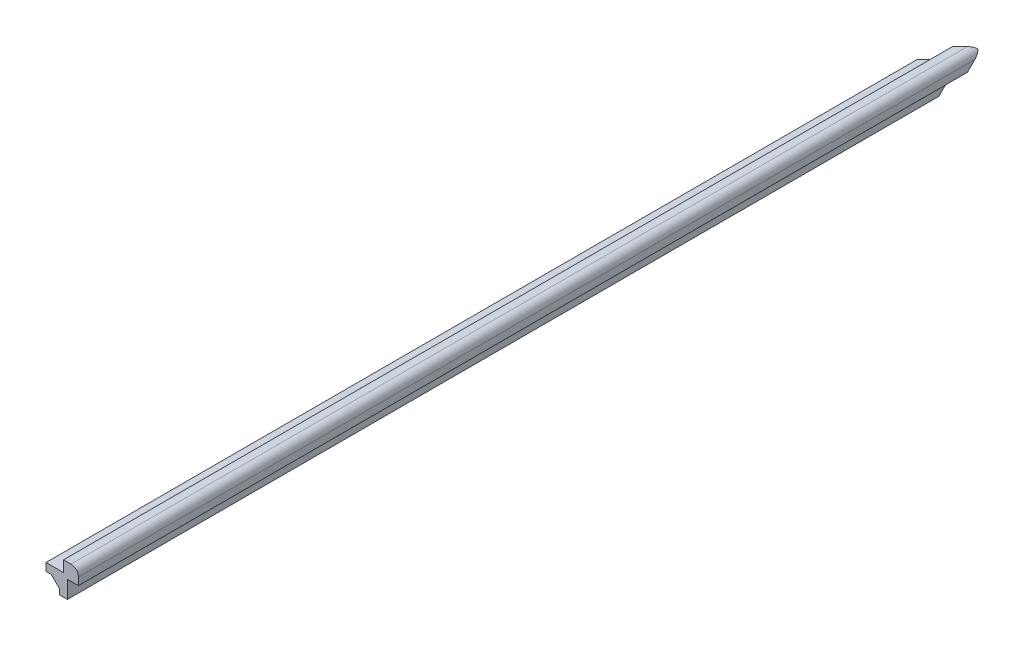
ISO-10303-21;
HEADER;
FILE_DESCRIPTION(('STEP AP214'),'2;1');
FILE_NAME('part.step','',(''),(''),'','','');
FILE_SCHEMA(('AUTOMOTIVE_DESIGN { 1 0 10303 214 1 1 1 1 }'));
ENDSEC;
DATA;
#1=APPLICATION_CONTEXT('core data for automotive mechanical design processes');
#2=APPLICATION_PROTOCOL_DEFINITION('international standard','automotive_design',2000,#1);
#3=PRODUCT_CONTEXT('',#1,'mechanical');
#4=PRODUCT('Part','Part','',(#3));
#5=PRODUCT_RELATED_PRODUCT_CATEGORY('part','',(#4));
#6=PRODUCT_DEFINITION_FORMATION('','',#4);
#7=PRODUCT_DEFINITION_CONTEXT('part definition',#1,'design');
#8=PRODUCT_DEFINITION('design','',#6,#7);
#9=PRODUCT_DEFINITION_SHAPE('','',#8);
#10=(LENGTH_UNIT() NAMED_UNIT(*) SI_UNIT(.MILLI.,.METRE.));
#11=(NAMED_UNIT(*) PLANE_ANGLE_UNIT() SI_UNIT($,.RADIAN.));
#12=(NAMED_UNIT(*) SI_UNIT($,.STERADIAN.) SOLID_ANGLE_UNIT());
#13=UNCERTAINTY_MEASURE_WITH_UNIT(LENGTH_MEASURE(1.E-05),#10,'distance_accuracy_value','');
#14=(GEOMETRIC_REPRESENTATION_CONTEXT(3) GLOBAL_UNCERTAINTY_ASSIGNED_CONTEXT((#13)) GLOBAL_UNIT_ASSIGNED_CONTEXT((#10,
#11,#12)) REPRESENTATION_CONTEXT('',''));
#15=CARTESIAN_POINT('',(0.,0.,0.));
#16=DIRECTION('',(0.,0.,1.));
#17=DIRECTION('',(1.,0.,0.));
#18=AXIS2_PLACEMENT_3D('',#15,#16,#17);
#19=CARTESIAN_POINT('',(-7.3025,-3.621225168,130.175));
#20=DIRECTION('',(0.,1.,0.));
#21=DIRECTION('',(0.,0.,1.));
#22=AXIS2_PLACEMENT_3D('',#19,#20,#21);
#23=PLANE('',#22);
#24=DIRECTION('',(0.,0.,-1.));
#25=VECTOR('',#24,1.);
#26=CARTESIAN_POINT('',(-7.3025,-3.621225168,130.175));
#27=LINE('',#26,#25);
#28=CARTESIAN_POINT('',(-7.3025,-3.621225168,130.175));
#29=VERTEX_POINT('',#28);
#30=CARTESIAN_POINT('',(-7.30249999999999,-3.621225168,-106.402378));
#31=VERTEX_POINT('',#30);
#32=EDGE_CURVE('E245',#29,#31,#27,.T.);
#33=ORIENTED_EDGE('',*,*,#32,.T.);
#34=DIRECTION('',(0.707106781186549,0.,-0.707106781186546));
#35=VECTOR('',#34,1.);
#36=CARTESIAN_POINT('',(-125.591189,-3.621225168,11.8863109999993));
#37=LINE('',#36,#35);
#38=CARTESIAN_POINT('',(-5.8662891982673,-3.62122516800001,-107.838588801733));
#39=VERTEX_POINT('',#38);
#40=EDGE_CURVE('E151',#31,#39,#37,.T.);
#41=ORIENTED_EDGE('',*,*,#40,.T.);
#42=DIRECTION('',(0.,0.,-1.));
#43=VECTOR('',#42,1.);
#44=CARTESIAN_POINT('',(-5.8662891982673,-3.621225168,130.175));
#45=LINE('',#44,#43);
#46=CARTESIAN_POINT('',(-5.8662891982673,-3.621225168,130.175));
#47=VERTEX_POINT('',#46);
#48=EDGE_CURVE('E63',#47,#39,#45,.T.);
#49=ORIENTED_EDGE('',*,*,#48,.F.);
#50=DIRECTION('',(1.,0.,0.));
#51=VECTOR('',#50,1.);
#52=CARTESIAN_POINT('',(-7.3025,-3.621225168,130.175));
#53=LINE('',#52,#51);
#54=EDGE_CURVE('E231',#29,#47,#53,.T.);
#55=ORIENTED_EDGE('',*,*,#54,.F.);
#56=EDGE_LOOP('',(#33,#41,#49,#55));
#57=FACE_BOUND('',#56,.T.);
#58=ADVANCED_FACE('F39',(#57),#23,.F.);
#59=CARTESIAN_POINT('',(-3.62122516800001,-2.53999999999999,130.175));
#60=DIRECTION('',(1.,0.,0.));
#61=DIRECTION('',(0.,1.,0.));
#62=AXIS2_PLACEMENT_3D('',#59,#60,#61);
#63=PLANE('',#62);
#64=DIRECTION('',(0.,0.,-1.));
#65=VECTOR('',#64,1.);
#66=CARTESIAN_POINT('',(-3.62122516800001,-5.86628919826729,130.175));
#67=LINE('',#66,#65);
#68=CARTESIAN_POINT('',(-3.62122516800002,-5.86628919826728,130.175));
#69=VERTEX_POINT('',#68);
#70=CARTESIAN_POINT('',(-3.62122516800004,-5.86628919826727,-107.838588801733));
#71=VERTEX_POINT('',#70);
#72=EDGE_CURVE('E196',#69,#71,#67,.T.);
#73=ORIENTED_EDGE('',*,*,#72,.T.);
#74=DIRECTION('',(0.,-0.707106781186547,0.707106781186548));
#75=VECTOR('',#74,1.);
#76=CARTESIAN_POINT('',(-3.62122516800041,-123.209939,9.50506100000018));
#77=LINE('',#76,#75);
#78=CARTESIAN_POINT('',(-3.62122516800002,-7.3025,-106.402378));
#79=VERTEX_POINT('',#78);
#80=EDGE_CURVE('E143',#71,#79,#77,.T.);
#81=ORIENTED_EDGE('',*,*,#80,.T.);
#82=DIRECTION('',(0.,0.,-1.));
#83=VECTOR('',#82,1.);
#84=CARTESIAN_POINT('',(-3.62122516800002,-7.30249999999999,130.175));
#85=LINE('',#84,#83);
#86=CARTESIAN_POINT('',(-3.62122516800002,-7.30249999999999,130.175));
#87=VERTEX_POINT('',#86);
#88=EDGE_CURVE('E223',#87,#79,#85,.T.);
#89=ORIENTED_EDGE('',*,*,#88,.F.);
#90=DIRECTION('',(0.,-1.,0.));
#91=VECTOR('',#90,1.);
#92=CARTESIAN_POINT('',(-3.62122516800001,-2.53999999999999,130.175));
#93=LINE('',#92,#91);
#94=EDGE_CURVE('E206',#69,#87,#93,.T.);
#95=ORIENTED_EDGE('',*,*,#94,.F.);
#96=EDGE_LOOP('',(#73,#81,#89,#95));
#97=FACE_BOUND('',#96,.T.);
#98=ADVANCED_FACE('F302',(#97),#63,.F.);
#99=CARTESIAN_POINT('',(-7.3025,-1.500000048,130.175));
#100=DIRECTION('',(1.,0.,0.));
#101=DIRECTION('',(0.,0.,-1.));
#102=AXIS2_PLACEMENT_3D('',#99,#100,#101);
#103=PLANE('',#102);
#104=DIRECTION('',(0.,0.,-1.));
#105=VECTOR('',#104,1.);
#106=CARTESIAN_POINT('',(-7.3025,-1.500000048,130.175));
#107=LINE('',#106,#105);
#108=CARTESIAN_POINT('',(-7.3025,-1.500000048,130.175));
#109=VERTEX_POINT('',#108);
#110=CARTESIAN_POINT('',(-7.3025,-1.500000048,-106.402378));
#111=VERTEX_POINT('',#110);
#112=EDGE_CURVE('E237',#109,#111,#107,.T.);
#113=ORIENTED_EDGE('',*,*,#112,.T.);
#114=DIRECTION('',(0.,-1.,0.));
#115=VECTOR('',#114,1.);
#116=CARTESIAN_POINT('',(-7.3025,-1.50000004800027,-106.402378));
#117=LINE('',#116,#115);
#118=EDGE_CURVE('E256',#111,#31,#117,.T.);
#119=ORIENTED_EDGE('',*,*,#118,.T.);
#120=ORIENTED_EDGE('',*,*,#32,.F.);
#121=DIRECTION('',(0.,-1.,0.));
#122=VECTOR('',#121,1.);
#123=CARTESIAN_POINT('',(-7.3025,-1.500000048,130.175));
#124=LINE('',#123,#122);
#125=EDGE_CURVE('E227',#109,#29,#124,.T.);
#126=ORIENTED_EDGE('',*,*,#125,.F.);
#127=EDGE_LOOP('',(#113,#119,#120,#126));
#128=FACE_BOUND('',#127,.T.);
#129=ADVANCED_FACE('F41',(#128),#103,.F.);
#130=CARTESIAN_POINT('',(-7.3025,-1.500000048,130.175));
#131=DIRECTION('',(0.,-1.,0.));
#132=DIRECTION('',(1.,0.,0.));
#133=AXIS2_PLACEMENT_3D('',#130,#131,#132);
#134=PLANE('',#133);
#135=DIRECTION('',(0.,0.,-1.));
#136=VECTOR('',#135,1.);
#137=CARTESIAN_POINT('',(-2.54,-1.500000048,130.175));
#138=LINE('',#137,#136);
#139=CARTESIAN_POINT('',(-2.54,-1.500000048,130.175));
#140=VERTEX_POINT('',#139);
#141=CARTESIAN_POINT('',(-2.54,-1.500000048,-111.164878));
#142=VERTEX_POINT('',#141);
#143=EDGE_CURVE('E241',#140,#142,#138,.T.);
#144=ORIENTED_EDGE('',*,*,#143,.T.);
#145=DIRECTION('',(-0.707106781186549,0.,0.707106781186546));
#146=VECTOR('',#145,1.);
#147=CARTESIAN_POINT('',(-125.591189,-1.50000004799996,11.8863109999993));
#148=LINE('',#147,#146);
#149=EDGE_CURVE('E259',#142,#111,#148,.T.);
#150=ORIENTED_EDGE('',*,*,#149,.T.);
#151=ORIENTED_EDGE('',*,*,#112,.F.);
#152=DIRECTION('',(-1.,0.,0.));
#153=VECTOR('',#152,1.);
#154=CARTESIAN_POINT('',(-7.3025,-1.500000048,130.175));
#155=LINE('',#154,#153);
#156=EDGE_CURVE('E234',#140,#109,#155,.T.);
#157=ORIENTED_EDGE('',*,*,#156,.F.);
#158=EDGE_LOOP('',(#144,#150,#151,#157));
#159=FACE_BOUND('',#158,.T.);
#160=ADVANCED_FACE('F307',(#159),#134,.F.);
#161=CARTESIAN_POINT('',(0.,0.,130.175));
#162=DIRECTION('',(0.,0.,1.));
#163=DIRECTION('',(1.,0.,0.));
#164=AXIS2_PLACEMENT_3D('',#161,#162,#163);
#165=PLANE('',#164);
#166=ORIENTED_EDGE('',*,*,#54,.T.);
#167=DIRECTION('',(0.707106781186547,-0.707106781186548,0.));
#168=VECTOR('',#167,1.);
#169=CARTESIAN_POINT('',(-5.8662891982673,-3.621225168,130.175));
#170=LINE('',#169,#168);
#171=EDGE_CURVE('E174',#47,#69,#170,.T.);
#172=ORIENTED_EDGE('',*,*,#171,.T.);
#173=ORIENTED_EDGE('',*,*,#94,.T.);
#174=DIRECTION('',(1.,0.,0.));
#175=VECTOR('',#174,1.);
#176=CARTESIAN_POINT('',(-1.50000004800003,-7.30249999999999,130.175));
#177=LINE('',#176,#175);
#178=CARTESIAN_POINT('',(-1.50000004800003,-7.30249999999999,130.175));
#179=VERTEX_POINT('',#178);
#180=EDGE_CURVE('E209',#87,#179,#177,.T.);
#181=ORIENTED_EDGE('',*,*,#180,.T.);
#182=DIRECTION('',(0.,1.,0.));
#183=VECTOR('',#182,1.);
#184=CARTESIAN_POINT('',(-1.50000004800001,-2.53999999999999,130.175));
#185=LINE('',#184,#183);
#186=CARTESIAN_POINT('',(-1.50000004800001,-2.53999999999999,130.175));
#187=VERTEX_POINT('',#186);
#188=EDGE_CURVE('E212',#179,#187,#185,.T.);
#189=ORIENTED_EDGE('',*,*,#188,.T.);
#190=DIRECTION('',(1.,0.,0.));
#191=VECTOR('',#190,1.);
#192=CARTESIAN_POINT('',(-1.50000004800001,-2.53999999999999,130.175));
#193=LINE('',#192,#191);
#194=CARTESIAN_POINT('',(1.50000004799999,-2.54,130.175));
#195=VERTEX_POINT('',#194);
#196=EDGE_CURVE('E178',#187,#195,#193,.T.);
#197=ORIENTED_EDGE('',*,*,#196,.T.);
#198=DIRECTION('',(0.,1.,0.));
#199=VECTOR('',#198,1.);
#200=CARTESIAN_POINT('',(1.50000004799999,-0.519999976000008,130.175));
#201=LINE('',#200,#199);
#202=CARTESIAN_POINT('',(1.50000004799999,-0.519999976000008,130.175));
#203=VERTEX_POINT('',#202);
#204=EDGE_CURVE('E181',#195,#203,#201,.T.);
#205=ORIENTED_EDGE('',*,*,#204,.T.);
#206=CARTESIAN_POINT('',(-0.519999976000015,-0.519999976000021,130.175));
#207=DIRECTION('',(0.,0.,1.));
#208=DIRECTION('',(-1.,0.,0.));
#209=AXIS2_PLACEMENT_3D('',#206,#207,#208);
#210=CIRCLE('',#209,2.02000002400001);
#211=CARTESIAN_POINT('',(-0.519999976000003,1.50000004799999,130.175));
#212=VERTEX_POINT('',#211);
#213=EDGE_CURVE('E184',#203,#212,#210,.T.);
#214=ORIENTED_EDGE('',*,*,#213,.T.);
#215=DIRECTION('',(-1.,0.,0.));
#216=VECTOR('',#215,1.);
#217=CARTESIAN_POINT('',(-2.54,1.500000048,130.175));
#218=LINE('',#217,#216);
#219=CARTESIAN_POINT('',(-2.54,1.500000048,130.175));
#220=VERTEX_POINT('',#219);
#221=EDGE_CURVE('E159',#212,#220,#218,.T.);
#222=ORIENTED_EDGE('',*,*,#221,.T.);
#223=DIRECTION('',(0.,-1.,0.));
#224=VECTOR('',#223,1.);
#225=CARTESIAN_POINT('',(-2.54,1.500000048,130.175));
#226=LINE('',#225,#224);
#227=EDGE_CURVE('E165',#220,#140,#226,.T.);
#228=ORIENTED_EDGE('',*,*,#227,.T.);
#229=ORIENTED_EDGE('',*,*,#156,.T.);
#230=ORIENTED_EDGE('',*,*,#125,.T.);
#231=EDGE_LOOP('',(#166,#172,#173,#181,#189,#197,#205,#214,#222,#228,#229,#230));
#232=FACE_BOUND('',#231,.T.);
#233=ADVANCED_FACE('F292',(#232),#165,.T.);
#234=CARTESIAN_POINT('',(-1.50000004800003,-7.30249999999999,130.175));
#235=DIRECTION('',(0.,1.,0.));
#236=DIRECTION('',(-1.,0.,0.));
#237=AXIS2_PLACEMENT_3D('',#234,#235,#236);
#238=PLANE('',#237);
#239=ORIENTED_EDGE('',*,*,#88,.T.);
#240=DIRECTION('',(1.,0.,0.));
#241=VECTOR('',#240,1.);
#242=CARTESIAN_POINT('',(-1.5000000479984,-7.30249999999999,-106.402378));
#243=LINE('',#242,#241);
#244=CARTESIAN_POINT('',(-1.50000004800003,-7.30249999999999,-106.402378));
#245=VERTEX_POINT('',#244);
#246=EDGE_CURVE('E274',#79,#245,#243,.T.);
#247=ORIENTED_EDGE('',*,*,#246,.T.);
#248=DIRECTION('',(0.,0.,-1.));
#249=VECTOR('',#248,1.);
#250=CARTESIAN_POINT('',(-1.50000004800003,-7.30249999999999,130.175));
#251=LINE('',#250,#249);
#252=EDGE_CURVE('E219',#179,#245,#251,.T.);
#253=ORIENTED_EDGE('',*,*,#252,.F.);
#254=ORIENTED_EDGE('',*,*,#180,.F.);
#255=EDGE_LOOP('',(#239,#247,#253,#254));
#256=FACE_BOUND('',#255,.T.);
#257=ADVANCED_FACE('F299',(#256),#238,.F.);
#258=CARTESIAN_POINT('',(-1.50000004800001,-2.53999999999999,130.175));
#259=DIRECTION('',(-1.,0.,0.));
#260=DIRECTION('',(0.,-1.,0.));
#261=AXIS2_PLACEMENT_3D('',#258,#259,#260);
#262=PLANE('',#261);
#263=ORIENTED_EDGE('',*,*,#252,.T.);
#264=DIRECTION('',(0.,0.707106781186547,-0.707106781186548));
#265=VECTOR('',#264,1.);
#266=CARTESIAN_POINT('',(-1.50000004800042,-123.209939,9.5050610000002));
#267=LINE('',#266,#265);
#268=CARTESIAN_POINT('',(-1.50000004800001,-2.54,-111.164878));
#269=VERTEX_POINT('',#268);
#270=EDGE_CURVE('E278',#245,#269,#267,.T.);
#271=ORIENTED_EDGE('',*,*,#270,.T.);
#272=DIRECTION('',(0.,0.,-1.));
#273=VECTOR('',#272,1.);
#274=CARTESIAN_POINT('',(-1.50000004800001,-2.53999999999999,130.175));
#275=LINE('',#274,#273);
#276=EDGE_CURVE('E215',#187,#269,#275,.T.);
#277=ORIENTED_EDGE('',*,*,#276,.F.);
#278=ORIENTED_EDGE('',*,*,#188,.F.);
#279=EDGE_LOOP('',(#263,#271,#277,#278));
#280=FACE_BOUND('',#279,.T.);
#281=ADVANCED_FACE('F297',(#280),#262,.F.);
#282=CARTESIAN_POINT('',(-0.519999976000015,-0.519999976000021,130.175));
#283=DIRECTION('',(0.,0.,-1.));
#284=DIRECTION('',(-1.,0.,0.));
#285=AXIS2_PLACEMENT_3D('',#282,#283,#284);
#286=CYLINDRICAL_SURFACE('',#285,2.02000002400001);
#287=DIRECTION('',(0.,0.,-1.));
#288=VECTOR('',#287,1.);
#289=CARTESIAN_POINT('',(1.50000004799999,-0.519999976000008,130.175));
#290=LINE('',#289,#288);
#291=CARTESIAN_POINT('',(1.50000004799999,-0.51999997600001,-113.184878024));
#292=VERTEX_POINT('',#291);
#293=EDGE_CURVE('E157',#203,#292,#290,.T.);
#294=ORIENTED_EDGE('',*,*,#293,.T.);
#295=CARTESIAN_POINT('',(-0.519999976000015,-0.519999976000021,-113.184878024));
#296=DIRECTION('',(0.,0.707106781186548,0.707106781186547));
#297=DIRECTION('',(0.,0.707106781186547,-0.707106781186548));
#298=AXIS2_PLACEMENT_3D('',#295,#296,#297);
#299=ELLIPSE('',#298,2.85671142993479,2.02000002400001);
#300=CARTESIAN_POINT('',(0.908355738967159,0.90835573896759,-114.613233738967));
#301=VERTEX_POINT('',#300);
#302=EDGE_CURVE('E147',#292,#301,#299,.T.);
#303=ORIENTED_EDGE('',*,*,#302,.T.);
#304=CARTESIAN_POINT('',(-0.519999976000015,-0.519999976000021,-113.184878024));
#305=DIRECTION('',(0.707106781186546,0.,0.707106781186549));
#306=DIRECTION('',(0.707106781186549,0.,-0.707106781186546));
#307=AXIS2_PLACEMENT_3D('',#304,#305,#306);
#308=ELLIPSE('',#307,2.85671142993478,2.02000002400001);
#309=CARTESIAN_POINT('',(-0.519999975999996,1.50000004799999,-113.184878024));
#310=VERTEX_POINT('',#309);
#311=EDGE_CURVE('E134',#301,#310,#308,.T.);
#312=ORIENTED_EDGE('',*,*,#311,.T.);
#313=DIRECTION('',(0.,0.,-1.));
#314=VECTOR('',#313,1.);
#315=CARTESIAN_POINT('',(-0.519999976000003,1.50000004799999,130.175));
#316=LINE('',#315,#314);
#317=EDGE_CURVE('E187',#212,#310,#316,.T.);
#318=ORIENTED_EDGE('',*,*,#317,.F.);
#319=ORIENTED_EDGE('',*,*,#213,.F.);
#320=EDGE_LOOP('',(#294,#303,#312,#318,#319));
#321=FACE_BOUND('',#320,.T.);
#322=ADVANCED_FACE('F154',(#321),#286,.T.);
#323=CARTESIAN_POINT('',(1.50000004799999,-0.519999976000008,130.175));
#324=DIRECTION('',(-1.,0.,0.));
#325=DIRECTION('',(0.,-1.,0.));
#326=AXIS2_PLACEMENT_3D('',#323,#324,#325);
#327=PLANE('',#326);
#328=DIRECTION('',(0.,0.,-1.));
#329=VECTOR('',#328,1.);
#330=CARTESIAN_POINT('',(1.50000004799999,-2.54,130.175));
#331=LINE('',#330,#329);
#332=CARTESIAN_POINT('',(1.50000004799999,-2.54,-111.164878));
#333=VERTEX_POINT('',#332);
#334=EDGE_CURVE('E192',#195,#333,#331,.T.);
#335=ORIENTED_EDGE('',*,*,#334,.T.);
#336=DIRECTION('',(0.,0.707106781186547,-0.707106781186548));
#337=VECTOR('',#336,1.);
#338=CARTESIAN_POINT('',(1.50000004799997,-122.199938988,8.49506098800021));
#339=LINE('',#338,#337);
#340=EDGE_CURVE('E160',#333,#292,#339,.T.);
#341=ORIENTED_EDGE('',*,*,#340,.T.);
#342=ORIENTED_EDGE('',*,*,#293,.F.);
#343=ORIENTED_EDGE('',*,*,#204,.F.);
#344=EDGE_LOOP('',(#335,#341,#342,#343));
#345=FACE_BOUND('',#344,.T.);
#346=ADVANCED_FACE('F290',(#345),#327,.F.);
#347=CARTESIAN_POINT('',(-1.50000004800001,-2.53999999999999,130.175));
#348=DIRECTION('',(0.,1.,0.));
#349=DIRECTION('',(-1.,0.,0.));
#350=AXIS2_PLACEMENT_3D('',#347,#348,#349);
#351=PLANE('',#350);
#352=ORIENTED_EDGE('',*,*,#276,.T.);
#353=DIRECTION('',(1.,0.,0.));
#354=VECTOR('',#353,1.);
#355=CARTESIAN_POINT('',(-1.50000004799837,-2.53999999999999,-111.164878));
#356=LINE('',#355,#354);
#357=EDGE_CURVE('E167',#269,#333,#356,.T.);
#358=ORIENTED_EDGE('',*,*,#357,.T.);
#359=ORIENTED_EDGE('',*,*,#334,.F.);
#360=ORIENTED_EDGE('',*,*,#196,.F.);
#361=EDGE_LOOP('',(#352,#358,#359,#360));
#362=FACE_BOUND('',#361,.T.);
#363=ADVANCED_FACE('F285',(#362),#351,.F.);
#364=CARTESIAN_POINT('',(-2.54,1.500000048,130.175));
#365=DIRECTION('',(1.,0.,0.));
#366=DIRECTION('',(0.,0.,-1.));
#367=AXIS2_PLACEMENT_3D('',#364,#365,#366);
#368=PLANE('',#367);
#369=DIRECTION('',(0.,0.,-1.));
#370=VECTOR('',#369,1.);
#371=CARTESIAN_POINT('',(-2.54,1.500000048,130.175));
#372=LINE('',#371,#370);
#373=CARTESIAN_POINT('',(-2.54,1.500000048,-111.164878));
#374=VERTEX_POINT('',#373);
#375=EDGE_CURVE('E202',#220,#374,#372,.T.);
#376=ORIENTED_EDGE('',*,*,#375,.T.);
#377=DIRECTION('',(0.,-1.,0.));
#378=VECTOR('',#377,1.);
#379=CARTESIAN_POINT('',(-2.54,1.50000004799972,-111.164878));
#380=LINE('',#379,#378);
#381=EDGE_CURVE('E265',#374,#142,#380,.T.);
#382=ORIENTED_EDGE('',*,*,#381,.T.);
#383=ORIENTED_EDGE('',*,*,#143,.F.);
#384=ORIENTED_EDGE('',*,*,#227,.F.);
#385=EDGE_LOOP('',(#376,#382,#383,#384));
#386=FACE_BOUND('',#385,.T.);
#387=ADVANCED_FACE('F310',(#386),#368,.F.);
#388=CARTESIAN_POINT('',(-2.54,1.500000048,130.175));
#389=DIRECTION('',(0.,-1.,0.));
#390=DIRECTION('',(1.,0.,0.));
#391=AXIS2_PLACEMENT_3D('',#388,#389,#390);
#392=PLANE('',#391);
#393=ORIENTED_EDGE('',*,*,#317,.T.);
#394=DIRECTION('',(-0.707106781186549,0.,0.707106781186546));
#395=VECTOR('',#394,1.);
#396=CARTESIAN_POINT('',(-123.209939,1.50000004800074,9.50506099999933));
#397=LINE('',#396,#395);
#398=EDGE_CURVE('E137',#310,#374,#397,.T.);
#399=ORIENTED_EDGE('',*,*,#398,.T.);
#400=ORIENTED_EDGE('',*,*,#375,.F.);
#401=ORIENTED_EDGE('',*,*,#221,.F.);
#402=EDGE_LOOP('',(#393,#399,#400,#401));
#403=FACE_BOUND('',#402,.T.);
#404=ADVANCED_FACE('F313',(#403),#392,.F.);
#405=CARTESIAN_POINT('',(-5.8662891982673,-3.621225168,130.175));
#406=DIRECTION('',(0.707106781186548,0.707106781186547,0.));
#407=DIRECTION('',(-0.707106781186547,0.707106781186548,0.));
#408=AXIS2_PLACEMENT_3D('',#405,#406,#407);
#409=PLANE('',#408);
#410=DIRECTION('',(0.577350269189627,-0.577350269189627,-0.577350269189624));
#411=VECTOR('',#410,1.);
#412=CARTESIAN_POINT('',(-85.2041521321781,75.7166377659109,-28.5007258678226));
#413=LINE('',#412,#411);
#414=CARTESIAN_POINT('',(-4.74375718313389,-4.74375718313342,-108.961120816866));
#415=VERTEX_POINT('',#414);
#416=EDGE_CURVE('E48',#39,#415,#413,.T.);
#417=ORIENTED_EDGE('',*,*,#416,.T.);
#418=DIRECTION('',(0.577350269189625,-0.577350269189625,0.577350269189628));
#419=VECTOR('',#418,1.);
#420=CARTESIAN_POINT('',(74.2199284123994,-83.7074427786668,-29.9974352213327));
#421=LINE('',#420,#419);
#422=EDGE_CURVE('E11',#415,#71,#421,.T.);
#423=ORIENTED_EDGE('',*,*,#422,.T.);
#424=ORIENTED_EDGE('',*,*,#72,.F.);
#425=ORIENTED_EDGE('',*,*,#171,.F.);
#426=ORIENTED_EDGE('',*,*,#48,.T.);
#427=EDGE_LOOP('',(#417,#423,#424,#425,#426));
#428=FACE_BOUND('',#427,.T.);
#429=ADVANCED_FACE('F250',(#428),#409,.F.);
#430=CARTESIAN_POINT('',(66.3584148391274,-23.4441463715636,-90.260731628436));
#431=DIRECTION('',(0.,0.707106781186548,0.707106781186547));
#432=DIRECTION('',(0.,-0.707106781186547,0.707106781186548));
#433=AXIS2_PLACEMENT_3D('',#430,#431,#432);
#434=PLANE('',#433);
#435=ORIENTED_EDGE('',*,*,#340,.F.);
#436=ORIENTED_EDGE('',*,*,#357,.F.);
#437=ORIENTED_EDGE('',*,*,#270,.F.);
#438=ORIENTED_EDGE('',*,*,#246,.F.);
#439=ORIENTED_EDGE('',*,*,#80,.F.);
#440=ORIENTED_EDGE('',*,*,#422,.F.);
#441=DIRECTION('',(-0.577350269189627,-0.577350269189626,0.577350269189625));
#442=VECTOR('',#441,1.);
#443=CARTESIAN_POINT('',(6.49004069866642,6.49004069866684,-120.194918698667));
#444=LINE('',#443,#442);
#445=EDGE_CURVE('E55',#301,#415,#444,.T.);
#446=ORIENTED_EDGE('',*,*,#445,.F.);
#447=ORIENTED_EDGE('',*,*,#302,.F.);
#448=EDGE_LOOP('',(#435,#436,#437,#438,#439,#440,#446,#447));
#449=FACE_BOUND('',#448,.T.);
#450=ADVANCED_FACE('F146',(#449),#434,.F.);
#451=CARTESIAN_POINT('',(6.49004069866642,6.49004069866684,-120.194918698667));
#452=DIRECTION('',(0.707106781186546,0.,0.707106781186549));
#453=DIRECTION('',(0.707106781186549,0.,-0.707106781186546));
#454=AXIS2_PLACEMENT_3D('',#451,#452,#453);
#455=PLANE('',#454);
#456=ORIENTED_EDGE('',*,*,#445,.T.);
#457=ORIENTED_EDGE('',*,*,#416,.F.);
#458=ORIENTED_EDGE('',*,*,#40,.F.);
#459=ORIENTED_EDGE('',*,*,#118,.F.);
#460=ORIENTED_EDGE('',*,*,#149,.F.);
#461=ORIENTED_EDGE('',*,*,#381,.F.);
#462=ORIENTED_EDGE('',*,*,#398,.F.);
#463=ORIENTED_EDGE('',*,*,#311,.F.);
#464=EDGE_LOOP('',(#456,#457,#458,#459,#460,#461,#462,#463));
#465=FACE_BOUND('',#464,.T.);
#466=ADVANCED_FACE('F135',(#465),#455,.F.);
#467=CLOSED_SHELL('',(#58,#98,#129,#160,#233,#257,#281,#322,#346,#363,#387,#404,#429,#450,#466));
#468=MANIFOLD_SOLID_BREP('B2',#467);
#469=ADVANCED_BREP_SHAPE_REPRESENTATION('',(#18,#468),#14);
#470=SHAPE_DEFINITION_REPRESENTATION(#9,#469);
ENDSEC;
END-ISO-10303-21;
